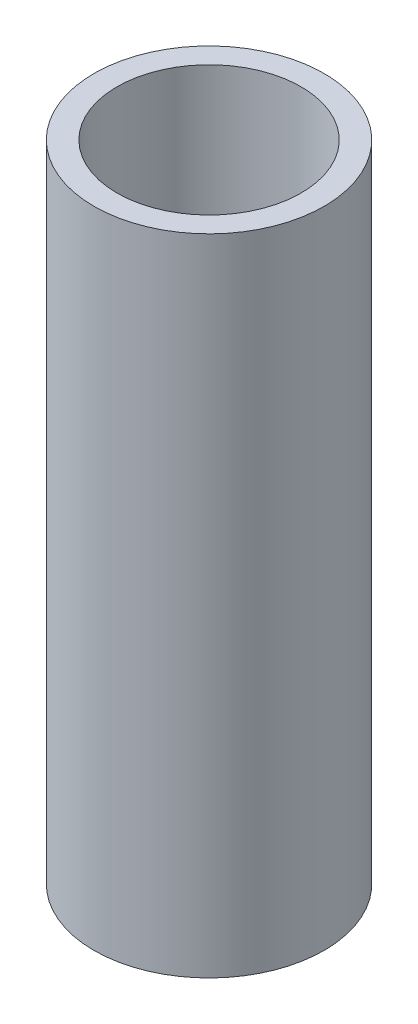
ISO-10303-21;
HEADER;
FILE_DESCRIPTION(('STEP AP214'),'2;1');
FILE_NAME('part.step','',(''),(''),'','','');
FILE_SCHEMA(('AUTOMOTIVE_DESIGN { 1 0 10303 214 1 1 1 1 }'));
ENDSEC;
DATA;
#1=APPLICATION_CONTEXT('core data for automotive mechanical design processes');
#2=APPLICATION_PROTOCOL_DEFINITION('international standard','automotive_design',2000,#1);
#3=PRODUCT_CONTEXT('',#1,'mechanical');
#4=PRODUCT('Part','Part','',(#3));
#5=PRODUCT_RELATED_PRODUCT_CATEGORY('part','',(#4));
#6=PRODUCT_DEFINITION_FORMATION('','',#4);
#7=PRODUCT_DEFINITION_CONTEXT('part definition',#1,'design');
#8=PRODUCT_DEFINITION('design','',#6,#7);
#9=PRODUCT_DEFINITION_SHAPE('','',#8);
#10=(LENGTH_UNIT() NAMED_UNIT(*) SI_UNIT(.MILLI.,.METRE.));
#11=(NAMED_UNIT(*) PLANE_ANGLE_UNIT() SI_UNIT($,.RADIAN.));
#12=(NAMED_UNIT(*) SI_UNIT($,.STERADIAN.) SOLID_ANGLE_UNIT());
#13=UNCERTAINTY_MEASURE_WITH_UNIT(LENGTH_MEASURE(1.E-05),#10,'distance_accuracy_value','');
#14=(GEOMETRIC_REPRESENTATION_CONTEXT(3) GLOBAL_UNCERTAINTY_ASSIGNED_CONTEXT((#13)) GLOBAL_UNIT_ASSIGNED_CONTEXT((#10,
#11,#12)) REPRESENTATION_CONTEXT('',''));
#15=CARTESIAN_POINT('',(0.,0.,0.));
#16=DIRECTION('',(0.,0.,1.));
#17=DIRECTION('',(1.,0.,0.));
#18=AXIS2_PLACEMENT_3D('',#15,#16,#17);
#19=CARTESIAN_POINT('',(0.,35.,0.));
#20=DIRECTION('',(0.,1.,0.));
#21=DIRECTION('',(0.,0.,1.));
#22=AXIS2_PLACEMENT_3D('',#19,#20,#21);
#23=PLANE('',#22);
#24=CARTESIAN_POINT('',(0.,35.,0.));
#25=DIRECTION('',(0.,1.,0.));
#26=DIRECTION('',(0.,0.,1.));
#27=AXIS2_PLACEMENT_3D('',#24,#25,#26);
#28=CIRCLE('',#27,12.5);
#29=CARTESIAN_POINT('',(0.,35.,12.5));
#30=VERTEX_POINT('',#29);
#31=EDGE_CURVE('E10',#30,#30,#28,.T.);
#32=ORIENTED_EDGE('',*,*,#31,.T.);
#33=EDGE_LOOP('',(#32));
#34=FACE_BOUND('',#33,.T.);
#35=CARTESIAN_POINT('',(0.,35.,0.));
#36=DIRECTION('',(0.,1.,0.));
#37=DIRECTION('',(0.,0.,1.));
#38=AXIS2_PLACEMENT_3D('',#35,#36,#37);
#39=CIRCLE('',#38,10.);
#40=CARTESIAN_POINT('',(0.,35.,10.));
#41=VERTEX_POINT('',#40);
#42=EDGE_CURVE('E46',#41,#41,#39,.T.);
#43=ORIENTED_EDGE('',*,*,#42,.F.);
#44=EDGE_LOOP('',(#43));
#45=FACE_BOUND('',#44,.T.);
#46=ADVANCED_FACE('F35',(#34,#45),#23,.T.);
#47=CARTESIAN_POINT('',(0.,-35.,0.));
#48=DIRECTION('',(0.,1.,0.));
#49=DIRECTION('',(0.,0.,1.));
#50=AXIS2_PLACEMENT_3D('',#47,#48,#49);
#51=PLANE('',#50);
#52=CARTESIAN_POINT('',(0.,-35.,0.));
#53=DIRECTION('',(0.,1.,0.));
#54=DIRECTION('',(0.,0.,1.));
#55=AXIS2_PLACEMENT_3D('',#52,#53,#54);
#56=CIRCLE('',#55,12.5);
#57=CARTESIAN_POINT('',(0.,-35.,12.5));
#58=VERTEX_POINT('',#57);
#59=EDGE_CURVE('E39',#58,#58,#56,.T.);
#60=ORIENTED_EDGE('',*,*,#59,.F.);
#61=EDGE_LOOP('',(#60));
#62=FACE_BOUND('',#61,.T.);
#63=CARTESIAN_POINT('',(0.,-35.,0.));
#64=DIRECTION('',(0.,1.,0.));
#65=DIRECTION('',(0.,0.,1.));
#66=AXIS2_PLACEMENT_3D('',#63,#64,#65);
#67=CIRCLE('',#66,10.);
#68=CARTESIAN_POINT('',(0.,-35.,10.));
#69=VERTEX_POINT('',#68);
#70=EDGE_CURVE('E48',#69,#69,#67,.T.);
#71=ORIENTED_EDGE('',*,*,#70,.T.);
#72=EDGE_LOOP('',(#71));
#73=FACE_BOUND('',#72,.T.);
#74=ADVANCED_FACE('F58',(#62,#73),#51,.F.);
#75=CARTESIAN_POINT('',(0.,35.,0.));
#76=DIRECTION('',(0.,-1.,0.));
#77=DIRECTION('',(0.,0.,-1.));
#78=AXIS2_PLACEMENT_3D('',#75,#76,#77);
#79=CYLINDRICAL_SURFACE('',#78,12.5);
#80=ORIENTED_EDGE('',*,*,#31,.F.);
#81=EDGE_LOOP('',(#80));
#82=FACE_BOUND('',#81,.T.);
#83=ORIENTED_EDGE('',*,*,#59,.T.);
#84=EDGE_LOOP('',(#83));
#85=FACE_BOUND('',#84,.T.);
#86=ADVANCED_FACE('F37',(#82,#85),#79,.T.);
#87=CARTESIAN_POINT('',(0.,35.,0.));
#88=DIRECTION('',(0.,-1.,0.));
#89=DIRECTION('',(0.,0.,-1.));
#90=AXIS2_PLACEMENT_3D('',#87,#88,#89);
#91=CYLINDRICAL_SURFACE('',#90,10.);
#92=ORIENTED_EDGE('',*,*,#42,.T.);
#93=EDGE_LOOP('',(#92));
#94=FACE_BOUND('',#93,.T.);
#95=ORIENTED_EDGE('',*,*,#70,.F.);
#96=EDGE_LOOP('',(#95));
#97=FACE_BOUND('',#96,.T.);
#98=ADVANCED_FACE('F54',(#94,#97),#91,.F.);
#99=CLOSED_SHELL('',(#46,#74,#86,#98));
#100=MANIFOLD_SOLID_BREP('B2',#99);
#101=ADVANCED_BREP_SHAPE_REPRESENTATION('',(#18,#100),#14);
#102=SHAPE_DEFINITION_REPRESENTATION(#9,#101);
ENDSEC;
END-ISO-10303-21;
